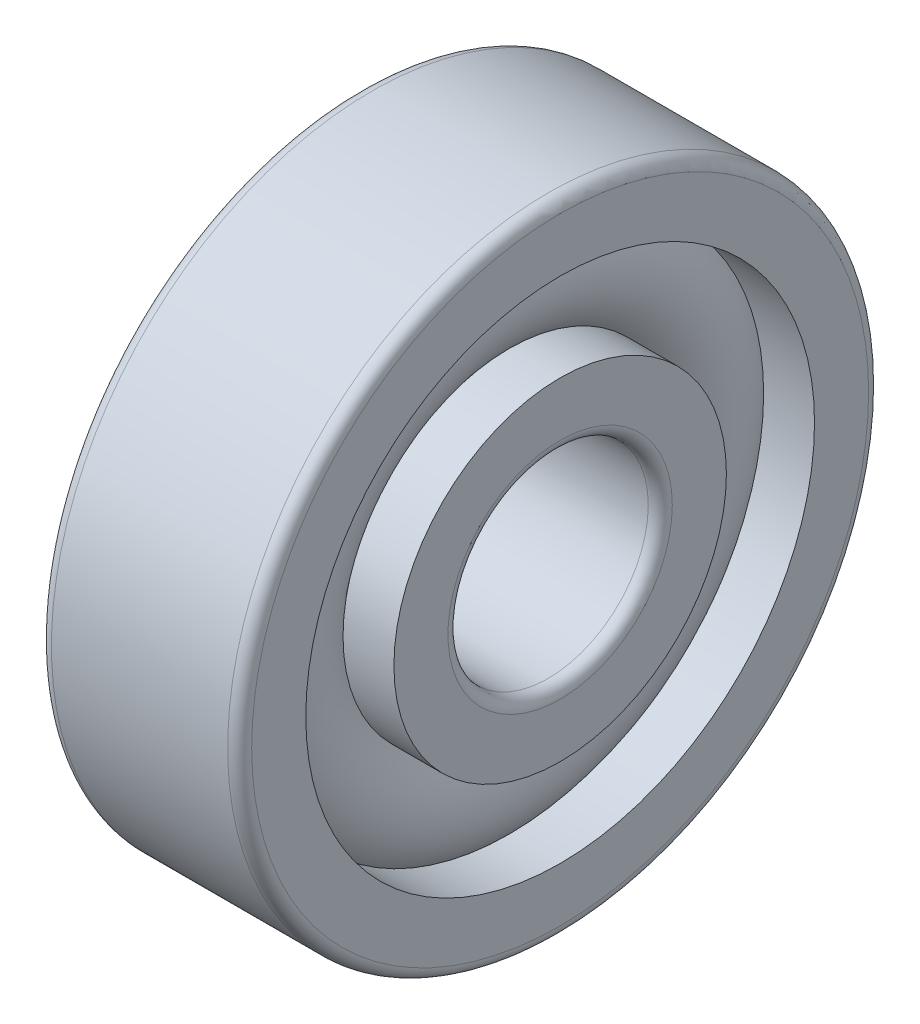
ISO-10303-21;
HEADER;
FILE_DESCRIPTION(('STEP AP214'),'2;1');
FILE_NAME('part.step','',(''),(''),'','','');
FILE_SCHEMA(('AUTOMOTIVE_DESIGN { 1 0 10303 214 1 1 1 1 }'));
ENDSEC;
DATA;
#1=APPLICATION_CONTEXT('core data for automotive mechanical design processes');
#2=APPLICATION_PROTOCOL_DEFINITION('international standard','automotive_design',2000,#1);
#3=PRODUCT_CONTEXT('',#1,'mechanical');
#4=PRODUCT('Part','Part','',(#3));
#5=PRODUCT_RELATED_PRODUCT_CATEGORY('part','',(#4));
#6=PRODUCT_DEFINITION_FORMATION('','',#4);
#7=PRODUCT_DEFINITION_CONTEXT('part definition',#1,'design');
#8=PRODUCT_DEFINITION('design','',#6,#7);
#9=PRODUCT_DEFINITION_SHAPE('','',#8);
#10=(LENGTH_UNIT() NAMED_UNIT(*) SI_UNIT(.MILLI.,.METRE.));
#11=(NAMED_UNIT(*) PLANE_ANGLE_UNIT() SI_UNIT($,.RADIAN.));
#12=(NAMED_UNIT(*) SI_UNIT($,.STERADIAN.) SOLID_ANGLE_UNIT());
#13=UNCERTAINTY_MEASURE_WITH_UNIT(LENGTH_MEASURE(1.E-05),#10,'distance_accuracy_value','');
#14=(GEOMETRIC_REPRESENTATION_CONTEXT(3) GLOBAL_UNCERTAINTY_ASSIGNED_CONTEXT((#13)) GLOBAL_UNIT_ASSIGNED_CONTEXT((#10,
#11,#12)) REPRESENTATION_CONTEXT('',''));
#15=CARTESIAN_POINT('',(0.,0.,0.));
#16=DIRECTION('',(0.,0.,1.));
#17=DIRECTION('',(1.,0.,0.));
#18=AXIS2_PLACEMENT_3D('',#15,#16,#17);
#19=CARTESIAN_POINT('',(0.,0.,0.));
#20=DIRECTION('',(-1.,0.,0.));
#21=DIRECTION('',(0.,0.,1.));
#22=AXIS2_PLACEMENT_3D('',#19,#20,#21);
#23=TOROIDAL_SURFACE('',#22,5.25,1.65);
#24=CARTESIAN_POINT('',(1.22983738762488,0.,0.));
#25=DIRECTION('',(-1.,0.,0.));
#26=DIRECTION('',(0.,0.,1.));
#27=AXIS2_PLACEMENT_3D('',#24,#25,#26);
#28=CIRCLE('',#27,6.35);
#29=CARTESIAN_POINT('',(1.22983738762488,0.,6.35));
#30=VERTEX_POINT('',#29);
#31=EDGE_CURVE('E18',#30,#30,#28,.F.);
#32=ORIENTED_EDGE('',*,*,#31,.T.);
#33=EDGE_LOOP('',(#32));
#34=FACE_BOUND('',#33,.T.);
#35=CARTESIAN_POINT('',(1.22983738762488,0.,0.));
#36=DIRECTION('',(-1.,0.,0.));
#37=DIRECTION('',(0.,0.,1.));
#38=AXIS2_PLACEMENT_3D('',#35,#36,#37);
#39=CIRCLE('',#38,4.15);
#40=CARTESIAN_POINT('',(1.22983738762488,0.,4.15));
#41=VERTEX_POINT('',#40);
#42=EDGE_CURVE('E10',#41,#41,#39,.T.);
#43=ORIENTED_EDGE('',*,*,#42,.T.);
#44=EDGE_LOOP('',(#43));
#45=FACE_BOUND('',#44,.T.);
#46=ADVANCED_FACE('F14',(#34,#45),#23,.T.);
#47=CARTESIAN_POINT('',(-20.6375,0.,0.));
#48=DIRECTION('',(1.,0.,0.));
#49=DIRECTION('',(0.,0.,-1.));
#50=AXIS2_PLACEMENT_3D('',#47,#48,#49);
#51=CYLINDRICAL_SURFACE('',#50,4.15);
#52=CARTESIAN_POINT('',(2.5,0.,0.));
#53=DIRECTION('',(1.,0.,0.));
#54=DIRECTION('',(0.,0.,-1.));
#55=AXIS2_PLACEMENT_3D('',#52,#53,#54);
#56=CIRCLE('',#55,4.15);
#57=CARTESIAN_POINT('',(2.5,0.,-4.15));
#58=VERTEX_POINT('',#57);
#59=EDGE_CURVE('E27',#58,#58,#56,.T.);
#60=ORIENTED_EDGE('',*,*,#59,.F.);
#61=EDGE_LOOP('',(#60));
#62=FACE_BOUND('',#61,.T.);
#63=ORIENTED_EDGE('',*,*,#42,.F.);
#64=EDGE_LOOP('',(#63));
#65=FACE_BOUND('',#64,.T.);
#66=ADVANCED_FACE('F66',(#62,#65),#51,.T.);
#67=CARTESIAN_POINT('',(-20.6375,0.,0.));
#68=DIRECTION('',(1.,0.,0.));
#69=DIRECTION('',(0.,0.,-1.));
#70=AXIS2_PLACEMENT_3D('',#67,#68,#69);
#71=CYLINDRICAL_SURFACE('',#70,4.15);
#72=CARTESIAN_POINT('',(-2.5,0.,0.));
#73=DIRECTION('',(1.,0.,0.));
#74=DIRECTION('',(0.,0.,-1.));
#75=AXIS2_PLACEMENT_3D('',#72,#73,#74);
#76=CIRCLE('',#75,4.15);
#77=CARTESIAN_POINT('',(-2.5,0.,-4.15));
#78=VERTEX_POINT('',#77);
#79=EDGE_CURVE('E36',#78,#78,#76,.T.);
#80=ORIENTED_EDGE('',*,*,#79,.T.);
#81=EDGE_LOOP('',(#80));
#82=FACE_BOUND('',#81,.T.);
#83=CARTESIAN_POINT('',(-1.22983738762488,0.,0.));
#84=DIRECTION('',(1.,0.,0.));
#85=DIRECTION('',(0.,0.,-1.));
#86=AXIS2_PLACEMENT_3D('',#83,#84,#85);
#87=CIRCLE('',#86,4.15);
#88=CARTESIAN_POINT('',(-1.22983738762488,0.,-4.15));
#89=VERTEX_POINT('',#88);
#90=EDGE_CURVE('E22',#89,#89,#87,.T.);
#91=ORIENTED_EDGE('',*,*,#90,.F.);
#92=EDGE_LOOP('',(#91));
#93=FACE_BOUND('',#92,.T.);
#94=ADVANCED_FACE('F69',(#82,#93),#71,.T.);
#95=CARTESIAN_POINT('',(2.5,2.8,0.));
#96=DIRECTION('',(1.,0.,0.));
#97=DIRECTION('',(0.,0.,-1.));
#98=AXIS2_PLACEMENT_3D('',#95,#96,#97);
#99=PLANE('',#98);
#100=ORIENTED_EDGE('',*,*,#59,.T.);
#101=EDGE_LOOP('',(#100));
#102=FACE_BOUND('',#101,.T.);
#103=CARTESIAN_POINT('',(2.5,0.,0.));
#104=DIRECTION('',(1.,0.,0.));
#105=DIRECTION('',(0.,0.,-1.));
#106=AXIS2_PLACEMENT_3D('',#103,#104,#105);
#107=CIRCLE('',#106,2.8);
#108=CARTESIAN_POINT('',(2.5,0.,-2.8));
#109=VERTEX_POINT('',#108);
#110=EDGE_CURVE('E58',#109,#109,#107,.T.);
#111=ORIENTED_EDGE('',*,*,#110,.F.);
#112=EDGE_LOOP('',(#111));
#113=FACE_BOUND('',#112,.T.);
#114=ADVANCED_FACE('F63',(#102,#113),#99,.T.);
#115=CARTESIAN_POINT('',(2.2,0.,0.));
#116=DIRECTION('',(1.,0.,0.));
#117=DIRECTION('',(0.,0.,-1.));
#118=AXIS2_PLACEMENT_3D('',#115,#116,#117);
#119=TOROIDAL_SURFACE('',#118,2.8,0.3);
#120=ORIENTED_EDGE('',*,*,#110,.T.);
#121=EDGE_LOOP('',(#120));
#122=FACE_BOUND('',#121,.T.);
#123=CARTESIAN_POINT('',(2.2,0.,0.));
#124=DIRECTION('',(1.,0.,0.));
#125=DIRECTION('',(0.,0.,-1.));
#126=AXIS2_PLACEMENT_3D('',#123,#124,#125);
#127=CIRCLE('',#126,2.5);
#128=CARTESIAN_POINT('',(2.2,0.,-2.5));
#129=VERTEX_POINT('',#128);
#130=EDGE_CURVE('E55',#129,#129,#127,.T.);
#131=ORIENTED_EDGE('',*,*,#130,.F.);
#132=EDGE_LOOP('',(#131));
#133=FACE_BOUND('',#132,.T.);
#134=ADVANCED_FACE('F82',(#122,#133),#119,.T.);
#135=CARTESIAN_POINT('',(-20.6375,0.,0.));
#136=DIRECTION('',(1.,0.,0.));
#137=DIRECTION('',(0.,0.,-1.));
#138=AXIS2_PLACEMENT_3D('',#135,#136,#137);
#139=CYLINDRICAL_SURFACE('',#138,2.5);
#140=ORIENTED_EDGE('',*,*,#130,.T.);
#141=EDGE_LOOP('',(#140));
#142=FACE_BOUND('',#141,.T.);
#143=CARTESIAN_POINT('',(-2.2,0.,0.));
#144=DIRECTION('',(1.,0.,0.));
#145=DIRECTION('',(0.,0.,-1.));
#146=AXIS2_PLACEMENT_3D('',#143,#144,#145);
#147=CIRCLE('',#146,2.5);
#148=CARTESIAN_POINT('',(-2.2,0.,-2.5));
#149=VERTEX_POINT('',#148);
#150=EDGE_CURVE('E52',#149,#149,#147,.T.);
#151=ORIENTED_EDGE('',*,*,#150,.F.);
#152=EDGE_LOOP('',(#151));
#153=FACE_BOUND('',#152,.T.);
#154=ADVANCED_FACE('F85',(#142,#153),#139,.F.);
#155=CARTESIAN_POINT('',(-2.2,0.,0.));
#156=DIRECTION('',(1.,0.,0.));
#157=DIRECTION('',(0.,0.,-1.));
#158=AXIS2_PLACEMENT_3D('',#155,#156,#157);
#159=TOROIDAL_SURFACE('',#158,2.8,0.3);
#160=ORIENTED_EDGE('',*,*,#150,.T.);
#161=EDGE_LOOP('',(#160));
#162=FACE_BOUND('',#161,.T.);
#163=CARTESIAN_POINT('',(-2.5,0.,0.));
#164=DIRECTION('',(1.,0.,0.));
#165=DIRECTION('',(0.,0.,-1.));
#166=AXIS2_PLACEMENT_3D('',#163,#164,#165);
#167=CIRCLE('',#166,2.8);
#168=CARTESIAN_POINT('',(-2.5,0.,-2.8));
#169=VERTEX_POINT('',#168);
#170=EDGE_CURVE('E49',#169,#169,#167,.T.);
#171=ORIENTED_EDGE('',*,*,#170,.F.);
#172=EDGE_LOOP('',(#171));
#173=FACE_BOUND('',#172,.T.);
#174=ADVANCED_FACE('F89',(#162,#173),#159,.T.);
#175=CARTESIAN_POINT('',(-2.5,4.15,0.));
#176=DIRECTION('',(-1.,0.,0.));
#177=DIRECTION('',(0.,0.,1.));
#178=AXIS2_PLACEMENT_3D('',#175,#176,#177);
#179=PLANE('',#178);
#180=ORIENTED_EDGE('',*,*,#170,.T.);
#181=EDGE_LOOP('',(#180));
#182=FACE_BOUND('',#181,.T.);
#183=ORIENTED_EDGE('',*,*,#79,.F.);
#184=EDGE_LOOP('',(#183));
#185=FACE_BOUND('',#184,.T.);
#186=ADVANCED_FACE('F93',(#182,#185),#179,.T.);
#187=CARTESIAN_POINT('',(-1.22983738762488,0.,0.));
#188=DIRECTION('',(1.,0.,0.));
#189=DIRECTION('',(0.,0.,-1.));
#190=AXIS2_PLACEMENT_3D('',#187,#188,#189);
#191=CIRCLE('',#190,6.35);
#192=CARTESIAN_POINT('',(-1.22983738762488,0.,-6.35));
#193=VERTEX_POINT('',#192);
#194=EDGE_CURVE('E30',#193,#193,#191,.F.);
#195=ORIENTED_EDGE('',*,*,#194,.T.);
#196=EDGE_LOOP('',(#195));
#197=FACE_BOUND('',#196,.T.);
#198=ORIENTED_EDGE('',*,*,#90,.T.);
#199=EDGE_LOOP('',(#198));
#200=FACE_BOUND('',#199,.T.);
#201=ADVANCED_FACE('F16',(#197,#200),#23,.T.);
#202=CARTESIAN_POINT('',(-20.6375,0.,0.));
#203=DIRECTION('',(1.,0.,0.));
#204=DIRECTION('',(0.,0.,-1.));
#205=AXIS2_PLACEMENT_3D('',#202,#203,#204);
#206=CYLINDRICAL_SURFACE('',#205,6.35);
#207=CARTESIAN_POINT('',(2.5,0.,0.));
#208=DIRECTION('',(1.,0.,0.));
#209=DIRECTION('',(0.,0.,-1.));
#210=AXIS2_PLACEMENT_3D('',#207,#208,#209);
#211=CIRCLE('',#210,6.35);
#212=CARTESIAN_POINT('',(2.5,0.,-6.35));
#213=VERTEX_POINT('',#212);
#214=EDGE_CURVE('E32',#213,#213,#211,.T.);
#215=ORIENTED_EDGE('',*,*,#214,.T.);
#216=EDGE_LOOP('',(#215));
#217=FACE_BOUND('',#216,.T.);
#218=ORIENTED_EDGE('',*,*,#31,.F.);
#219=EDGE_LOOP('',(#218));
#220=FACE_BOUND('',#219,.T.);
#221=ADVANCED_FACE('F98',(#217,#220),#206,.F.);
#222=CARTESIAN_POINT('',(-20.6375,0.,0.));
#223=DIRECTION('',(1.,0.,0.));
#224=DIRECTION('',(0.,0.,-1.));
#225=AXIS2_PLACEMENT_3D('',#222,#223,#224);
#226=CYLINDRICAL_SURFACE('',#225,6.35);
#227=CARTESIAN_POINT('',(-2.5,0.,0.));
#228=DIRECTION('',(1.,0.,0.));
#229=DIRECTION('',(0.,0.,-1.));
#230=AXIS2_PLACEMENT_3D('',#227,#228,#229);
#231=CIRCLE('',#230,6.35);
#232=CARTESIAN_POINT('',(-2.5,0.,-6.35));
#233=VERTEX_POINT('',#232);
#234=EDGE_CURVE('E130',#233,#233,#231,.T.);
#235=ORIENTED_EDGE('',*,*,#234,.F.);
#236=EDGE_LOOP('',(#235));
#237=FACE_BOUND('',#236,.T.);
#238=ORIENTED_EDGE('',*,*,#194,.F.);
#239=EDGE_LOOP('',(#238));
#240=FACE_BOUND('',#239,.T.);
#241=ADVANCED_FACE('F101',(#237,#240),#226,.F.);
#242=CARTESIAN_POINT('',(2.5,7.7,0.));
#243=DIRECTION('',(1.,0.,0.));
#244=DIRECTION('',(0.,0.,-1.));
#245=AXIS2_PLACEMENT_3D('',#242,#243,#244);
#246=PLANE('',#245);
#247=CARTESIAN_POINT('',(2.5,0.,0.));
#248=DIRECTION('',(1.,0.,0.));
#249=DIRECTION('',(0.,0.,-1.));
#250=AXIS2_PLACEMENT_3D('',#247,#248,#249);
#251=CIRCLE('',#250,7.7);
#252=CARTESIAN_POINT('',(2.5,0.,-7.7));
#253=VERTEX_POINT('',#252);
#254=EDGE_CURVE('E38',#253,#253,#251,.T.);
#255=ORIENTED_EDGE('',*,*,#254,.T.);
#256=EDGE_LOOP('',(#255));
#257=FACE_BOUND('',#256,.T.);
#258=ORIENTED_EDGE('',*,*,#214,.F.);
#259=EDGE_LOOP('',(#258));
#260=FACE_BOUND('',#259,.T.);
#261=ADVANCED_FACE('F102',(#257,#260),#246,.T.);
#262=CARTESIAN_POINT('',(2.2,0.,0.));
#263=DIRECTION('',(1.,0.,0.));
#264=DIRECTION('',(0.,0.,-1.));
#265=AXIS2_PLACEMENT_3D('',#262,#263,#264);
#266=TOROIDAL_SURFACE('',#265,7.7,0.3);
#267=CARTESIAN_POINT('',(2.2,0.,0.));
#268=DIRECTION('',(1.,0.,0.));
#269=DIRECTION('',(0.,0.,-1.));
#270=AXIS2_PLACEMENT_3D('',#267,#268,#269);
#271=CIRCLE('',#270,8.);
#272=CARTESIAN_POINT('',(2.2,0.,-8.));
#273=VERTEX_POINT('',#272);
#274=EDGE_CURVE('E43',#273,#273,#271,.T.);
#275=ORIENTED_EDGE('',*,*,#274,.T.);
#276=EDGE_LOOP('',(#275));
#277=FACE_BOUND('',#276,.T.);
#278=ORIENTED_EDGE('',*,*,#254,.F.);
#279=EDGE_LOOP('',(#278));
#280=FACE_BOUND('',#279,.T.);
#281=ADVANCED_FACE('F105',(#277,#280),#266,.T.);
#282=CARTESIAN_POINT('',(-20.6375,0.,0.));
#283=DIRECTION('',(1.,0.,0.));
#284=DIRECTION('',(0.,0.,-1.));
#285=AXIS2_PLACEMENT_3D('',#282,#283,#284);
#286=CYLINDRICAL_SURFACE('',#285,8.);
#287=CARTESIAN_POINT('',(-2.2,0.,0.));
#288=DIRECTION('',(1.,0.,0.));
#289=DIRECTION('',(0.,0.,-1.));
#290=AXIS2_PLACEMENT_3D('',#287,#288,#289);
#291=CIRCLE('',#290,8.);
#292=CARTESIAN_POINT('',(-2.2,0.,-8.));
#293=VERTEX_POINT('',#292);
#294=EDGE_CURVE('E134',#293,#293,#291,.T.);
#295=ORIENTED_EDGE('',*,*,#294,.T.);
#296=EDGE_LOOP('',(#295));
#297=FACE_BOUND('',#296,.T.);
#298=ORIENTED_EDGE('',*,*,#274,.F.);
#299=EDGE_LOOP('',(#298));
#300=FACE_BOUND('',#299,.T.);
#301=ADVANCED_FACE('F109',(#297,#300),#286,.T.);
#302=CARTESIAN_POINT('',(-2.2,0.,0.));
#303=DIRECTION('',(1.,0.,0.));
#304=DIRECTION('',(0.,0.,-1.));
#305=AXIS2_PLACEMENT_3D('',#302,#303,#304);
#306=TOROIDAL_SURFACE('',#305,7.7,0.3);
#307=CARTESIAN_POINT('',(-2.5,0.,0.));
#308=DIRECTION('',(1.,0.,0.));
#309=DIRECTION('',(0.,0.,-1.));
#310=AXIS2_PLACEMENT_3D('',#307,#308,#309);
#311=CIRCLE('',#310,7.7);
#312=CARTESIAN_POINT('',(-2.5,0.,-7.7));
#313=VERTEX_POINT('',#312);
#314=EDGE_CURVE('E131',#313,#313,#311,.T.);
#315=ORIENTED_EDGE('',*,*,#314,.T.);
#316=EDGE_LOOP('',(#315));
#317=FACE_BOUND('',#316,.T.);
#318=ORIENTED_EDGE('',*,*,#294,.F.);
#319=EDGE_LOOP('',(#318));
#320=FACE_BOUND('',#319,.T.);
#321=ADVANCED_FACE('F113',(#317,#320),#306,.T.);
#322=CARTESIAN_POINT('',(-2.5,6.35,0.));
#323=DIRECTION('',(-1.,0.,0.));
#324=DIRECTION('',(0.,0.,1.));
#325=AXIS2_PLACEMENT_3D('',#322,#323,#324);
#326=PLANE('',#325);
#327=ORIENTED_EDGE('',*,*,#234,.T.);
#328=EDGE_LOOP('',(#327));
#329=FACE_BOUND('',#328,.T.);
#330=ORIENTED_EDGE('',*,*,#314,.F.);
#331=EDGE_LOOP('',(#330));
#332=FACE_BOUND('',#331,.T.);
#333=ADVANCED_FACE('F117',(#329,#332),#326,.T.);
#334=CLOSED_SHELL('',(#46,#66,#94,#114,#134,#154,#174,#186,#201,#221,#241,#261,#281,#301,#321,#333));
#335=MANIFOLD_SOLID_BREP('B1',#334);
#336=ADVANCED_BREP_SHAPE_REPRESENTATION('',(#18,#335),#14);
#337=SHAPE_DEFINITION_REPRESENTATION(#9,#336);
ENDSEC;
END-ISO-10303-21;
